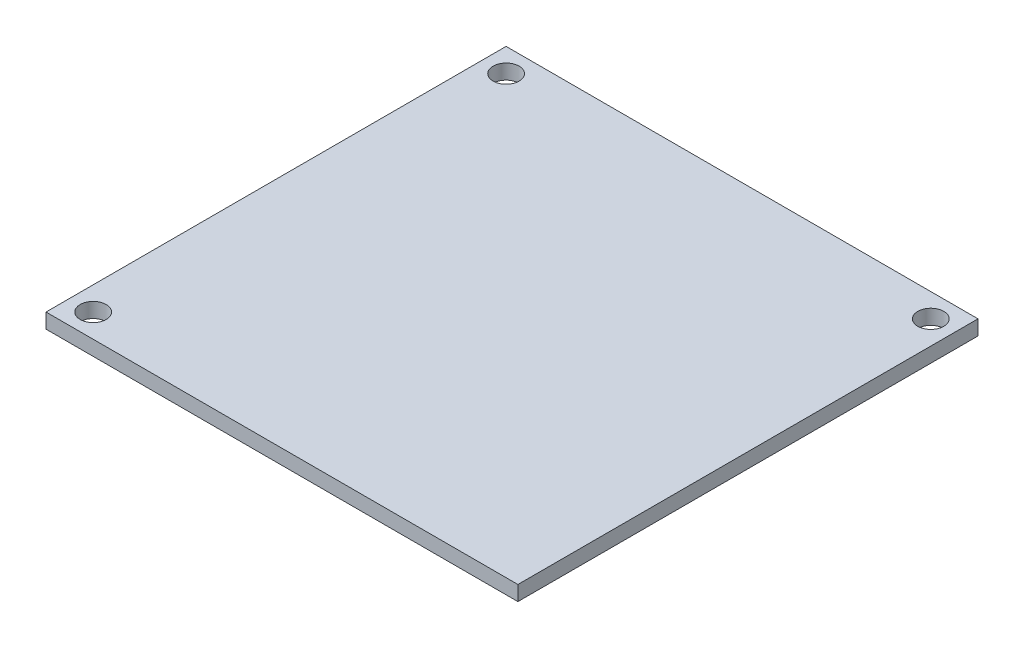
ISO-10303-21;
HEADER;
FILE_DESCRIPTION(('STEP AP214'),'2;1');
FILE_NAME('part.step','',(''),(''),'','','');
FILE_SCHEMA(('AUTOMOTIVE_DESIGN { 1 0 10303 214 1 1 1 1 }'));
ENDSEC;
DATA;
#1=APPLICATION_CONTEXT('core data for automotive mechanical design processes');
#2=APPLICATION_PROTOCOL_DEFINITION('international standard','automotive_design',2000,#1);
#3=PRODUCT_CONTEXT('',#1,'mechanical');
#4=PRODUCT('Part','Part','',(#3));
#5=PRODUCT_RELATED_PRODUCT_CATEGORY('part','',(#4));
#6=PRODUCT_DEFINITION_FORMATION('','',#4);
#7=PRODUCT_DEFINITION_CONTEXT('part definition',#1,'design');
#8=PRODUCT_DEFINITION('design','',#6,#7);
#9=PRODUCT_DEFINITION_SHAPE('','',#8);
#10=(LENGTH_UNIT() NAMED_UNIT(*) SI_UNIT(.MILLI.,.METRE.));
#11=(NAMED_UNIT(*) PLANE_ANGLE_UNIT() SI_UNIT($,.RADIAN.));
#12=(NAMED_UNIT(*) SI_UNIT($,.STERADIAN.) SOLID_ANGLE_UNIT());
#13=UNCERTAINTY_MEASURE_WITH_UNIT(LENGTH_MEASURE(1.E-05),#10,'distance_accuracy_value','');
#14=(GEOMETRIC_REPRESENTATION_CONTEXT(3) GLOBAL_UNCERTAINTY_ASSIGNED_CONTEXT((#13)) GLOBAL_UNIT_ASSIGNED_CONTEXT((#10,
#11,#12)) REPRESENTATION_CONTEXT('',''));
#15=CARTESIAN_POINT('',(0.,0.,0.));
#16=DIRECTION('',(0.,0.,1.));
#17=DIRECTION('',(1.,0.,0.));
#18=AXIS2_PLACEMENT_3D('',#15,#16,#17);
#19=CARTESIAN_POINT('',(-25.4,1.6,24.765));
#20=DIRECTION('',(1.,0.,0.));
#21=DIRECTION('',(0.,0.,-1.));
#22=AXIS2_PLACEMENT_3D('',#19,#20,#21);
#23=PLANE('',#22);
#24=DIRECTION('',(0.,0.,1.));
#25=VECTOR('',#24,1.);
#26=CARTESIAN_POINT('',(-25.4,0.,24.765));
#27=LINE('',#26,#25);
#28=CARTESIAN_POINT('',(-25.4,0.,-24.765));
#29=VERTEX_POINT('',#28);
#30=CARTESIAN_POINT('',(-25.4,0.,24.765));
#31=VERTEX_POINT('',#30);
#32=EDGE_CURVE('E96',#29,#31,#27,.T.);
#33=ORIENTED_EDGE('',*,*,#32,.T.);
#34=DIRECTION('',(0.,-1.,0.));
#35=VECTOR('',#34,1.);
#36=CARTESIAN_POINT('',(-25.4,1.6,24.765));
#37=LINE('',#36,#35);
#38=CARTESIAN_POINT('',(-25.4,1.6,24.765));
#39=VERTEX_POINT('',#38);
#40=EDGE_CURVE('E11',#39,#31,#37,.T.);
#41=ORIENTED_EDGE('',*,*,#40,.F.);
#42=DIRECTION('',(0.,0.,1.));
#43=VECTOR('',#42,1.);
#44=CARTESIAN_POINT('',(-25.4,1.6,24.765));
#45=LINE('',#44,#43);
#46=CARTESIAN_POINT('',(-25.4,1.6,-24.765));
#47=VERTEX_POINT('',#46);
#48=EDGE_CURVE('E84',#47,#39,#45,.T.);
#49=ORIENTED_EDGE('',*,*,#48,.F.);
#50=DIRECTION('',(0.,-1.,0.));
#51=VECTOR('',#50,1.);
#52=CARTESIAN_POINT('',(-25.4,1.6,-24.765));
#53=LINE('',#52,#51);
#54=EDGE_CURVE('E92',#47,#29,#53,.T.);
#55=ORIENTED_EDGE('',*,*,#54,.T.);
#56=EDGE_LOOP('',(#33,#41,#49,#55));
#57=FACE_BOUND('',#56,.T.);
#58=ADVANCED_FACE('F33',(#57),#23,.F.);
#59=CARTESIAN_POINT('',(25.4,1.6,24.765));
#60=DIRECTION('',(0.,0.,-1.));
#61=DIRECTION('',(-1.,0.,0.));
#62=AXIS2_PLACEMENT_3D('',#59,#60,#61);
#63=PLANE('',#62);
#64=DIRECTION('',(1.,0.,0.));
#65=VECTOR('',#64,1.);
#66=CARTESIAN_POINT('',(25.4,0.,24.765));
#67=LINE('',#66,#65);
#68=CARTESIAN_POINT('',(25.4,0.,24.765));
#69=VERTEX_POINT('',#68);
#70=EDGE_CURVE('E88',#31,#69,#67,.T.);
#71=ORIENTED_EDGE('',*,*,#70,.T.);
#72=DIRECTION('',(0.,-1.,0.));
#73=VECTOR('',#72,1.);
#74=CARTESIAN_POINT('',(25.4,1.6,24.765));
#75=LINE('',#74,#73);
#76=CARTESIAN_POINT('',(25.4,1.6,24.765));
#77=VERTEX_POINT('',#76);
#78=EDGE_CURVE('E41',#77,#69,#75,.T.);
#79=ORIENTED_EDGE('',*,*,#78,.F.);
#80=DIRECTION('',(1.,0.,0.));
#81=VECTOR('',#80,1.);
#82=CARTESIAN_POINT('',(25.4,1.6,24.765));
#83=LINE('',#82,#81);
#84=EDGE_CURVE('E79',#39,#77,#83,.T.);
#85=ORIENTED_EDGE('',*,*,#84,.F.);
#86=ORIENTED_EDGE('',*,*,#40,.T.);
#87=EDGE_LOOP('',(#71,#79,#85,#86));
#88=FACE_BOUND('',#87,.T.);
#89=ADVANCED_FACE('F87',(#88),#63,.F.);
#90=CARTESIAN_POINT('',(25.4,1.6,24.765));
#91=DIRECTION('',(-1.,0.,0.));
#92=DIRECTION('',(0.,0.,1.));
#93=AXIS2_PLACEMENT_3D('',#90,#91,#92);
#94=PLANE('',#93);
#95=DIRECTION('',(0.,0.,-1.));
#96=VECTOR('',#95,1.);
#97=CARTESIAN_POINT('',(25.4,0.,24.765));
#98=LINE('',#97,#96);
#99=CARTESIAN_POINT('',(25.4,0.,-24.765));
#100=VERTEX_POINT('',#99);
#101=EDGE_CURVE('E66',#69,#100,#98,.T.);
#102=ORIENTED_EDGE('',*,*,#101,.T.);
#103=DIRECTION('',(0.,-1.,0.));
#104=VECTOR('',#103,1.);
#105=CARTESIAN_POINT('',(25.4,1.6,-24.765));
#106=LINE('',#105,#104);
#107=CARTESIAN_POINT('',(25.4,1.6,-24.765));
#108=VERTEX_POINT('',#107);
#109=EDGE_CURVE('E89',#108,#100,#106,.T.);
#110=ORIENTED_EDGE('',*,*,#109,.F.);
#111=DIRECTION('',(0.,0.,-1.));
#112=VECTOR('',#111,1.);
#113=CARTESIAN_POINT('',(25.4,1.6,24.765));
#114=LINE('',#113,#112);
#115=EDGE_CURVE('E82',#77,#108,#114,.T.);
#116=ORIENTED_EDGE('',*,*,#115,.F.);
#117=ORIENTED_EDGE('',*,*,#78,.T.);
#118=EDGE_LOOP('',(#102,#110,#116,#117));
#119=FACE_BOUND('',#118,.T.);
#120=ADVANCED_FACE('F90',(#119),#94,.F.);
#121=CARTESIAN_POINT('',(25.4,1.6,-24.765));
#122=DIRECTION('',(0.,0.,1.));
#123=DIRECTION('',(1.,0.,0.));
#124=AXIS2_PLACEMENT_3D('',#121,#122,#123);
#125=PLANE('',#124);
#126=DIRECTION('',(-1.,0.,0.));
#127=VECTOR('',#126,1.);
#128=CARTESIAN_POINT('',(25.4,0.,-24.765));
#129=LINE('',#128,#127);
#130=EDGE_CURVE('E72',#100,#29,#129,.T.);
#131=ORIENTED_EDGE('',*,*,#130,.T.);
#132=ORIENTED_EDGE('',*,*,#54,.F.);
#133=DIRECTION('',(-1.,0.,0.));
#134=VECTOR('',#133,1.);
#135=CARTESIAN_POINT('',(25.4,1.6,-24.765));
#136=LINE('',#135,#134);
#137=EDGE_CURVE('E49',#108,#47,#136,.T.);
#138=ORIENTED_EDGE('',*,*,#137,.F.);
#139=ORIENTED_EDGE('',*,*,#109,.T.);
#140=EDGE_LOOP('',(#131,#132,#138,#139));
#141=FACE_BOUND('',#140,.T.);
#142=ADVANCED_FACE('F104',(#141),#125,.F.);
#143=CARTESIAN_POINT('',(0.,1.6,0.));
#144=DIRECTION('',(0.,1.,0.));
#145=DIRECTION('',(0.,0.,1.));
#146=AXIS2_PLACEMENT_3D('',#143,#144,#145);
#147=PLANE('',#146);
#148=CARTESIAN_POINT('',(-22.86,1.6,22.225));
#149=DIRECTION('',(0.,1.,0.));
#150=DIRECTION('',(0.,0.,1.));
#151=AXIS2_PLACEMENT_3D('',#148,#149,#150);
#152=CIRCLE('',#151,1.4);
#153=CARTESIAN_POINT('',(-22.86,1.6,23.625));
#154=VERTEX_POINT('',#153);
#155=EDGE_CURVE('E122',#154,#154,#152,.T.);
#156=ORIENTED_EDGE('',*,*,#155,.F.);
#157=EDGE_LOOP('',(#156));
#158=FACE_BOUND('',#157,.T.);
#159=CARTESIAN_POINT('',(22.86,1.6,-22.225));
#160=DIRECTION('',(0.,1.,0.));
#161=DIRECTION('',(0.,0.,1.));
#162=AXIS2_PLACEMENT_3D('',#159,#160,#161);
#163=CIRCLE('',#162,1.4);
#164=CARTESIAN_POINT('',(22.86,1.6,-20.825));
#165=VERTEX_POINT('',#164);
#166=EDGE_CURVE('E116',#165,#165,#163,.T.);
#167=ORIENTED_EDGE('',*,*,#166,.F.);
#168=EDGE_LOOP('',(#167));
#169=FACE_BOUND('',#168,.T.);
#170=CARTESIAN_POINT('',(-22.86,1.6,-22.225));
#171=DIRECTION('',(0.,1.,0.));
#172=DIRECTION('',(0.,0.,1.));
#173=AXIS2_PLACEMENT_3D('',#170,#171,#172);
#174=CIRCLE('',#173,1.4);
#175=CARTESIAN_POINT('',(-22.86,1.6,-20.825));
#176=VERTEX_POINT('',#175);
#177=EDGE_CURVE('E110',#176,#176,#174,.T.);
#178=ORIENTED_EDGE('',*,*,#177,.F.);
#179=EDGE_LOOP('',(#178));
#180=FACE_BOUND('',#179,.T.);
#181=ORIENTED_EDGE('',*,*,#48,.T.);
#182=ORIENTED_EDGE('',*,*,#84,.T.);
#183=ORIENTED_EDGE('',*,*,#115,.T.);
#184=ORIENTED_EDGE('',*,*,#137,.T.);
#185=EDGE_LOOP('',(#181,#182,#183,#184));
#186=FACE_BOUND('',#185,.T.);
#187=ADVANCED_FACE('F80',(#158,#169,#180,#186),#147,.T.);
#188=CARTESIAN_POINT('',(0.,0.,0.));
#189=DIRECTION('',(0.,1.,0.));
#190=DIRECTION('',(0.,0.,1.));
#191=AXIS2_PLACEMENT_3D('',#188,#189,#190);
#192=PLANE('',#191);
#193=CARTESIAN_POINT('',(-22.86,0.,22.225));
#194=DIRECTION('',(0.,1.,0.));
#195=DIRECTION('',(0.,0.,1.));
#196=AXIS2_PLACEMENT_3D('',#193,#194,#195);
#197=CIRCLE('',#196,1.4);
#198=CARTESIAN_POINT('',(-22.86,0.,23.625));
#199=VERTEX_POINT('',#198);
#200=EDGE_CURVE('E119',#199,#199,#197,.T.);
#201=ORIENTED_EDGE('',*,*,#200,.T.);
#202=EDGE_LOOP('',(#201));
#203=FACE_BOUND('',#202,.T.);
#204=CARTESIAN_POINT('',(22.86,0.,-22.225));
#205=DIRECTION('',(0.,1.,0.));
#206=DIRECTION('',(0.,0.,1.));
#207=AXIS2_PLACEMENT_3D('',#204,#205,#206);
#208=CIRCLE('',#207,1.4);
#209=CARTESIAN_POINT('',(22.86,0.,-20.825));
#210=VERTEX_POINT('',#209);
#211=EDGE_CURVE('E113',#210,#210,#208,.T.);
#212=ORIENTED_EDGE('',*,*,#211,.T.);
#213=EDGE_LOOP('',(#212));
#214=FACE_BOUND('',#213,.T.);
#215=CARTESIAN_POINT('',(-22.86,0.,-22.225));
#216=DIRECTION('',(0.,1.,0.));
#217=DIRECTION('',(0.,0.,1.));
#218=AXIS2_PLACEMENT_3D('',#215,#216,#217);
#219=CIRCLE('',#218,1.4);
#220=CARTESIAN_POINT('',(-22.86,0.,-20.825));
#221=VERTEX_POINT('',#220);
#222=EDGE_CURVE('E99',#221,#221,#219,.T.);
#223=ORIENTED_EDGE('',*,*,#222,.T.);
#224=EDGE_LOOP('',(#223));
#225=FACE_BOUND('',#224,.T.);
#226=ORIENTED_EDGE('',*,*,#32,.F.);
#227=ORIENTED_EDGE('',*,*,#130,.F.);
#228=ORIENTED_EDGE('',*,*,#101,.F.);
#229=ORIENTED_EDGE('',*,*,#70,.F.);
#230=EDGE_LOOP('',(#226,#227,#228,#229));
#231=FACE_BOUND('',#230,.T.);
#232=ADVANCED_FACE('F107',(#203,#214,#225,#231),#192,.F.);
#233=CARTESIAN_POINT('',(-22.86,0.,-22.225));
#234=DIRECTION('',(0.,1.,0.));
#235=DIRECTION('',(0.,0.,1.));
#236=AXIS2_PLACEMENT_3D('',#233,#234,#235);
#237=CYLINDRICAL_SURFACE('',#236,1.4);
#238=ORIENTED_EDGE('',*,*,#222,.F.);
#239=EDGE_LOOP('',(#238));
#240=FACE_BOUND('',#239,.T.);
#241=ORIENTED_EDGE('',*,*,#177,.T.);
#242=EDGE_LOOP('',(#241));
#243=FACE_BOUND('',#242,.T.);
#244=ADVANCED_FACE('F144',(#240,#243),#237,.F.);
#245=CARTESIAN_POINT('',(22.86,0.,-22.225));
#246=DIRECTION('',(0.,1.,0.));
#247=DIRECTION('',(0.,0.,1.));
#248=AXIS2_PLACEMENT_3D('',#245,#246,#247);
#249=CYLINDRICAL_SURFACE('',#248,1.4);
#250=ORIENTED_EDGE('',*,*,#211,.F.);
#251=EDGE_LOOP('',(#250));
#252=FACE_BOUND('',#251,.T.);
#253=ORIENTED_EDGE('',*,*,#166,.T.);
#254=EDGE_LOOP('',(#253));
#255=FACE_BOUND('',#254,.T.);
#256=ADVANCED_FACE('F133',(#252,#255),#249,.F.);
#257=CARTESIAN_POINT('',(-22.86,0.,22.225));
#258=DIRECTION('',(0.,1.,0.));
#259=DIRECTION('',(0.,0.,1.));
#260=AXIS2_PLACEMENT_3D('',#257,#258,#259);
#261=CYLINDRICAL_SURFACE('',#260,1.4);
#262=ORIENTED_EDGE('',*,*,#200,.F.);
#263=EDGE_LOOP('',(#262));
#264=FACE_BOUND('',#263,.T.);
#265=ORIENTED_EDGE('',*,*,#155,.T.);
#266=EDGE_LOOP('',(#265));
#267=FACE_BOUND('',#266,.T.);
#268=ADVANCED_FACE('F130',(#264,#267),#261,.F.);
#269=CLOSED_SHELL('',(#58,#89,#120,#142,#187,#232,#244,#256,#268));
#270=MANIFOLD_SOLID_BREP('B2',#269);
#271=ADVANCED_BREP_SHAPE_REPRESENTATION('',(#18,#270),#14);
#272=SHAPE_DEFINITION_REPRESENTATION(#9,#271);
ENDSEC;
END-ISO-10303-21;
